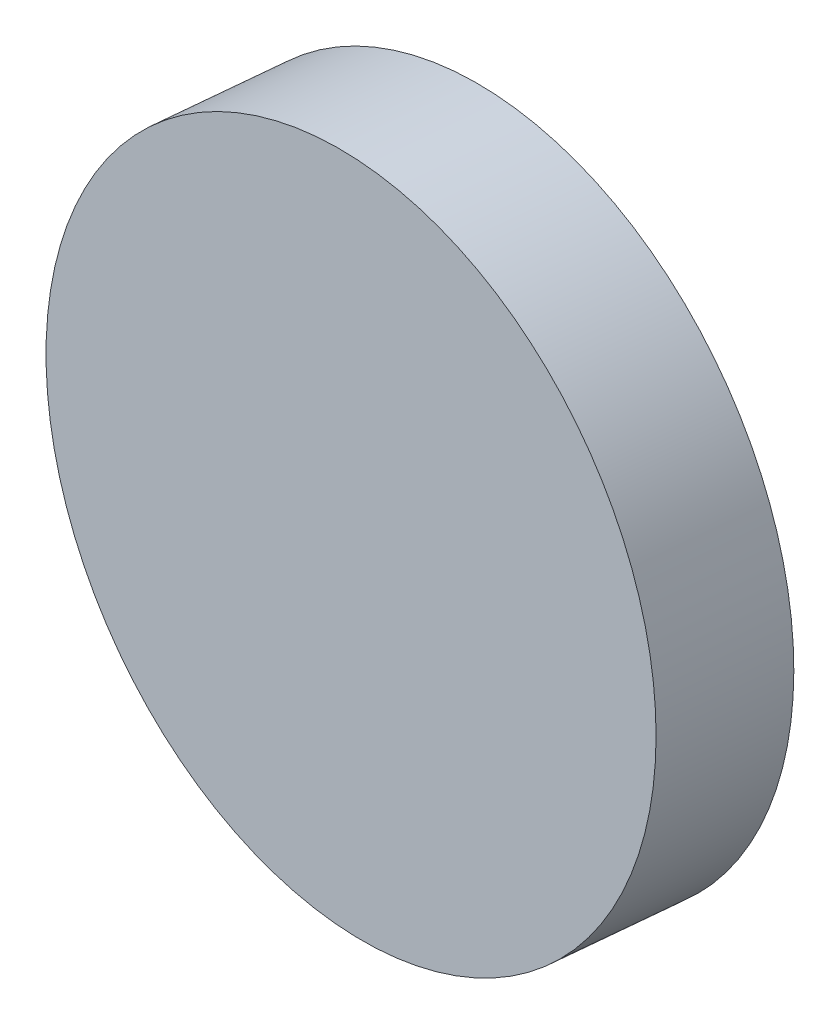
ISO-10303-21;
HEADER;
FILE_DESCRIPTION(('STEP AP214'),'2;1');
FILE_NAME('part.step','',(''),(''),'','','');
FILE_SCHEMA(('AUTOMOTIVE_DESIGN { 1 0 10303 214 1 1 1 1 }'));
ENDSEC;
DATA;
#1=APPLICATION_CONTEXT('core data for automotive mechanical design processes');
#2=APPLICATION_PROTOCOL_DEFINITION('international standard','automotive_design',2000,#1);
#3=PRODUCT_CONTEXT('',#1,'mechanical');
#4=PRODUCT('Part','Part','',(#3));
#5=PRODUCT_RELATED_PRODUCT_CATEGORY('part','',(#4));
#6=PRODUCT_DEFINITION_FORMATION('','',#4);
#7=PRODUCT_DEFINITION_CONTEXT('part definition',#1,'design');
#8=PRODUCT_DEFINITION('design','',#6,#7);
#9=PRODUCT_DEFINITION_SHAPE('','',#8);
#10=(LENGTH_UNIT() NAMED_UNIT(*) SI_UNIT(.MILLI.,.METRE.));
#11=(NAMED_UNIT(*) PLANE_ANGLE_UNIT() SI_UNIT($,.RADIAN.));
#12=(NAMED_UNIT(*) SI_UNIT($,.STERADIAN.) SOLID_ANGLE_UNIT());
#13=UNCERTAINTY_MEASURE_WITH_UNIT(LENGTH_MEASURE(1.E-05),#10,'distance_accuracy_value','');
#14=(GEOMETRIC_REPRESENTATION_CONTEXT(3) GLOBAL_UNCERTAINTY_ASSIGNED_CONTEXT((#13)) GLOBAL_UNIT_ASSIGNED_CONTEXT((#10,
#11,#12)) REPRESENTATION_CONTEXT('',''));
#15=CARTESIAN_POINT('',(0.,0.,0.));
#16=DIRECTION('',(0.,0.,1.));
#17=DIRECTION('',(1.,0.,0.));
#18=AXIS2_PLACEMENT_3D('',#15,#16,#17);
#19=CARTESIAN_POINT('',(65.5373821792766,53.5151571741995,4.75544618733264));
#20=DIRECTION('',(-0.0686986071921701,0.0254724257214802,0.997312216358408));
#21=DIRECTION('',(0.347656354702279,0.937622023544202,0.));
#22=AXIS2_PLACEMENT_3D('',#19,#20,#21);
#23=PLANE('',#22);
#24=CARTESIAN_POINT('',(65.5373821792766,53.5151571741995,4.75544618733264));
#25=DIRECTION('',(-0.0686986071921701,0.0254724257214802,0.997312216358408));
#26=DIRECTION('',(0.997587996762566,-0.00820059045625883,0.0689270558737252));
#27=AXIS2_PLACEMENT_3D('',#24,#25,#26);
#28=CIRCLE('',#27,12.7);
#29=CARTESIAN_POINT('',(52.868014620392,53.619304672994,3.88007257773633));
#30=VERTEX_POINT('',#29);
#31=EDGE_CURVE('E11',#30,#30,#28,.T.);
#32=ORIENTED_EDGE('',*,*,#31,.F.);
#33=EDGE_LOOP('',(#32));
#34=FACE_BOUND('',#33,.T.);
#35=ADVANCED_FACE('F17',(#34),#23,.F.);
#36=CARTESIAN_POINT('',(65.1938891433158,53.6425193028069,9.74200726912468));
#37=DIRECTION('',(-0.0686986071921701,0.0254724257214802,0.997312216358408));
#38=DIRECTION('',(0.347656354702279,0.937622023544202,0.));
#39=AXIS2_PLACEMENT_3D('',#36,#37,#38);
#40=PLANE('',#39);
#41=CARTESIAN_POINT('',(65.1938891433158,53.6425193028069,9.74200726912468));
#42=DIRECTION('',(-0.0686986071921701,0.0254724257214802,0.997312216358408));
#43=DIRECTION('',(0.997587996762566,-0.00820059045625883,0.0689270558737252));
#44=AXIS2_PLACEMENT_3D('',#41,#42,#43);
#45=CIRCLE('',#44,12.7);
#46=CARTESIAN_POINT('',(52.5245215844312,53.7466668016014,8.86663365952836));
#47=VERTEX_POINT('',#46);
#48=EDGE_CURVE('E42',#47,#47,#45,.T.);
#49=ORIENTED_EDGE('',*,*,#48,.T.);
#50=EDGE_LOOP('',(#49));
#51=FACE_BOUND('',#50,.T.);
#52=ADVANCED_FACE('F19',(#51),#40,.T.);
#53=CARTESIAN_POINT('',(65.5373821792766,53.5151571741995,4.75544618733264));
#54=DIRECTION('',(-0.0686986071921701,0.0254724257214802,0.997312216358408));
#55=DIRECTION('',(0.997587996762566,-0.00820059045625883,0.0689270558737252));
#56=AXIS2_PLACEMENT_3D('',#53,#54,#55);
#57=CYLINDRICAL_SURFACE('',#56,12.7);
#58=ORIENTED_EDGE('',*,*,#48,.F.);
#59=DIRECTION('',(0.0686986071921701,-0.0254724257214802,-0.997312216358408));
#60=VECTOR('',#59,1.);
#61=CARTESIAN_POINT('',(52.868014620392,53.619304672994,3.88007257773633));
#62=LINE('',#61,#60);
#63=EDGE_CURVE('E26',#47,#30,#62,.T.);
#64=ORIENTED_EDGE('',*,*,#63,.T.);
#65=ORIENTED_EDGE('',*,*,#31,.T.);
#66=ORIENTED_EDGE('',*,*,#63,.F.);
#67=EDGE_LOOP('',(#58,#64,#65,#66));
#68=FACE_BOUND('',#67,.T.);
#69=ADVANCED_FACE('F41',(#68),#57,.T.);
#70=CLOSED_SHELL('',(#35,#52,#69));
#71=MANIFOLD_SOLID_BREP('B1',#70);
#72=ADVANCED_BREP_SHAPE_REPRESENTATION('',(#18,#71),#14);
#73=SHAPE_DEFINITION_REPRESENTATION(#9,#72);
ENDSEC;
END-ISO-10303-21;
